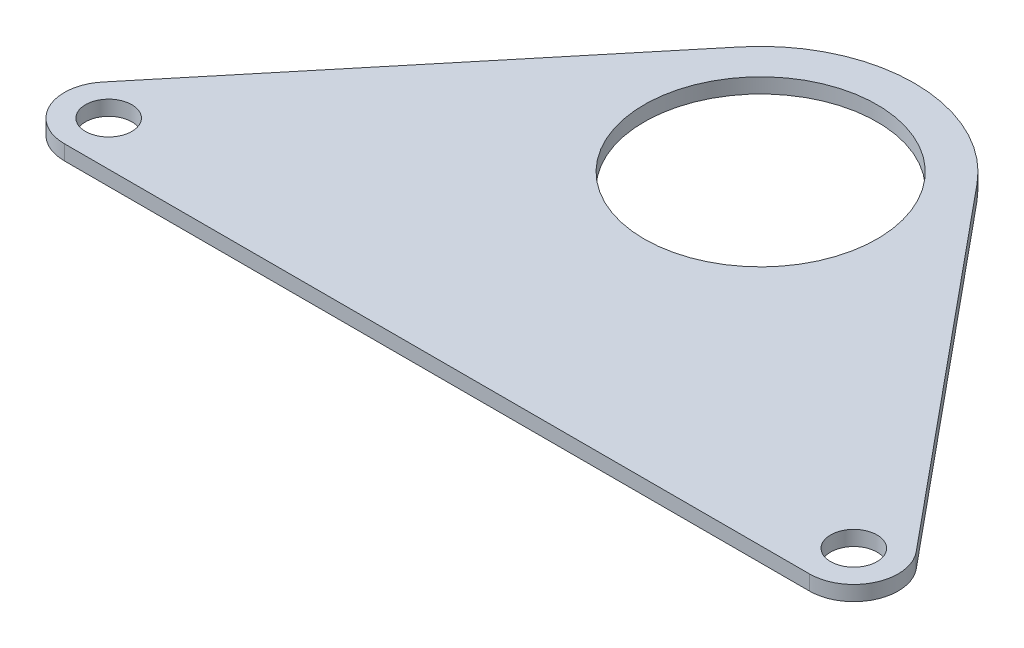
ISO-10303-21;
HEADER;
FILE_DESCRIPTION(('STEP AP214'),'2;1');
FILE_NAME('part.step','',(''),(''),'','','');
FILE_SCHEMA(('AUTOMOTIVE_DESIGN { 1 0 10303 214 1 1 1 1 }'));
ENDSEC;
DATA;
#1=APPLICATION_CONTEXT('core data for automotive mechanical design processes');
#2=APPLICATION_PROTOCOL_DEFINITION('international standard','automotive_design',2000,#1);
#3=PRODUCT_CONTEXT('',#1,'mechanical');
#4=PRODUCT('Part','Part','',(#3));
#5=PRODUCT_RELATED_PRODUCT_CATEGORY('part','',(#4));
#6=PRODUCT_DEFINITION_FORMATION('','',#4);
#7=PRODUCT_DEFINITION_CONTEXT('part definition',#1,'design');
#8=PRODUCT_DEFINITION('design','',#6,#7);
#9=PRODUCT_DEFINITION_SHAPE('','',#8);
#10=(LENGTH_UNIT() NAMED_UNIT(*) SI_UNIT(.MILLI.,.METRE.));
#11=(NAMED_UNIT(*) PLANE_ANGLE_UNIT() SI_UNIT($,.RADIAN.));
#12=(NAMED_UNIT(*) SI_UNIT($,.STERADIAN.) SOLID_ANGLE_UNIT());
#13=UNCERTAINTY_MEASURE_WITH_UNIT(LENGTH_MEASURE(1.E-05),#10,'distance_accuracy_value','');
#14=(GEOMETRIC_REPRESENTATION_CONTEXT(3) GLOBAL_UNCERTAINTY_ASSIGNED_CONTEXT((#13)) GLOBAL_UNIT_ASSIGNED_CONTEXT((#10,
#11,#12)) REPRESENTATION_CONTEXT('',''));
#15=CARTESIAN_POINT('',(0.,0.,0.));
#16=DIRECTION('',(0.,0.,1.));
#17=DIRECTION('',(1.,0.,0.));
#18=AXIS2_PLACEMENT_3D('',#15,#16,#17);
#19=CARTESIAN_POINT('',(-40.,1.6002,30.));
#20=DIRECTION('',(0.,-1.,0.));
#21=DIRECTION('',(0.,0.,-1.));
#22=AXIS2_PLACEMENT_3D('',#19,#20,#21);
#23=CYLINDRICAL_SURFACE('',#22,4.76250000000001);
#24=CARTESIAN_POINT('',(-40.,0.,30.));
#25=DIRECTION('',(0.,1.,0.));
#26=DIRECTION('',(0.,0.,1.));
#27=AXIS2_PLACEMENT_3D('',#24,#25,#26);
#28=CIRCLE('',#27,4.76250000000001);
#29=CARTESIAN_POINT('',(-40.,0.,34.7625));
#30=VERTEX_POINT('',#29);
#31=CARTESIAN_POINT('',(-43.6720468885112,0.,26.9672656069851));
#32=VERTEX_POINT('',#31);
#33=EDGE_CURVE('E122',#30,#32,#28,.F.);
#34=ORIENTED_EDGE('',*,*,#33,.F.);
#35=DIRECTION('',(0.,-1.,0.));
#36=VECTOR('',#35,1.);
#37=CARTESIAN_POINT('',(-40.,1.6002,34.7625));
#38=LINE('',#37,#36);
#39=CARTESIAN_POINT('',(-40.,1.6002,34.7625));
#40=VERTEX_POINT('',#39);
#41=EDGE_CURVE('E11',#40,#30,#38,.T.);
#42=ORIENTED_EDGE('',*,*,#41,.F.);
#43=CARTESIAN_POINT('',(-40.,1.6002,30.));
#44=DIRECTION('',(0.,1.,0.));
#45=DIRECTION('',(0.,0.,1.));
#46=AXIS2_PLACEMENT_3D('',#43,#44,#45);
#47=CIRCLE('',#46,4.76250000000001);
#48=CARTESIAN_POINT('',(-43.6720468885112,1.6002,26.9672656069851));
#49=VERTEX_POINT('',#48);
#50=EDGE_CURVE('E138',#40,#49,#47,.F.);
#51=ORIENTED_EDGE('',*,*,#50,.T.);
#52=DIRECTION('',(0.,-1.,0.));
#53=VECTOR('',#52,1.);
#54=CARTESIAN_POINT('',(-43.6720468885112,1.6002,26.9672656069851));
#55=LINE('',#54,#53);
#56=EDGE_CURVE('E80',#49,#32,#55,.T.);
#57=ORIENTED_EDGE('',*,*,#56,.T.);
#58=EDGE_LOOP('',(#34,#42,#51,#57));
#59=FACE_BOUND('',#58,.T.);
#60=ADVANCED_FACE('F34',(#59),#23,.T.);
#61=CARTESIAN_POINT('',(0.,1.6002,34.7625));
#62=DIRECTION('',(0.,0.,-1.));
#63=DIRECTION('',(-1.,0.,0.));
#64=AXIS2_PLACEMENT_3D('',#61,#62,#63);
#65=PLANE('',#64);
#66=DIRECTION('',(1.,0.,0.));
#67=VECTOR('',#66,1.);
#68=CARTESIAN_POINT('',(0.,0.,34.7625));
#69=LINE('',#68,#67);
#70=CARTESIAN_POINT('',(40.,0.,34.7625));
#71=VERTEX_POINT('',#70);
#72=EDGE_CURVE('E125',#30,#71,#69,.T.);
#73=ORIENTED_EDGE('',*,*,#72,.T.);
#74=DIRECTION('',(0.,-1.,0.));
#75=VECTOR('',#74,1.);
#76=CARTESIAN_POINT('',(40.,1.6002,34.7625));
#77=LINE('',#76,#75);
#78=CARTESIAN_POINT('',(40.,1.6002,34.7625));
#79=VERTEX_POINT('',#78);
#80=EDGE_CURVE('E43',#79,#71,#77,.T.);
#81=ORIENTED_EDGE('',*,*,#80,.F.);
#82=DIRECTION('',(1.,0.,0.));
#83=VECTOR('',#82,1.);
#84=CARTESIAN_POINT('',(0.,1.6002,34.7625));
#85=LINE('',#84,#83);
#86=EDGE_CURVE('E114',#40,#79,#85,.T.);
#87=ORIENTED_EDGE('',*,*,#86,.F.);
#88=ORIENTED_EDGE('',*,*,#41,.T.);
#89=EDGE_LOOP('',(#73,#81,#87,#88));
#90=FACE_BOUND('',#89,.T.);
#91=ADVANCED_FACE('F157',(#90),#65,.F.);
#92=CARTESIAN_POINT('',(40.,1.6002,30.));
#93=DIRECTION('',(0.,-1.,0.));
#94=DIRECTION('',(0.,0.,-1.));
#95=AXIS2_PLACEMENT_3D('',#92,#93,#94);
#96=CYLINDRICAL_SURFACE('',#95,4.76250000000001);
#97=CARTESIAN_POINT('',(40.,0.,30.));
#98=DIRECTION('',(0.,1.,0.));
#99=DIRECTION('',(0.,0.,1.));
#100=AXIS2_PLACEMENT_3D('',#97,#98,#99);
#101=CIRCLE('',#100,4.76250000000001);
#102=CARTESIAN_POINT('',(43.6720468885112,0.,26.9672656069851));
#103=VERTEX_POINT('',#102);
#104=EDGE_CURVE('E128',#71,#103,#101,.T.);
#105=ORIENTED_EDGE('',*,*,#104,.T.);
#106=DIRECTION('',(0.,-1.,0.));
#107=VECTOR('',#106,1.);
#108=CARTESIAN_POINT('',(43.6720468885112,1.6002,26.9672656069851));
#109=LINE('',#108,#107);
#110=CARTESIAN_POINT('',(43.6720468885112,1.6002,26.9672656069851));
#111=VERTEX_POINT('',#110);
#112=EDGE_CURVE('E102',#111,#103,#109,.T.);
#113=ORIENTED_EDGE('',*,*,#112,.F.);
#114=CARTESIAN_POINT('',(40.,1.6002,30.));
#115=DIRECTION('',(0.,1.,0.));
#116=DIRECTION('',(0.,0.,1.));
#117=AXIS2_PLACEMENT_3D('',#114,#115,#116);
#118=CIRCLE('',#117,4.76250000000001);
#119=EDGE_CURVE('E111',#79,#111,#118,.T.);
#120=ORIENTED_EDGE('',*,*,#119,.F.);
#121=ORIENTED_EDGE('',*,*,#80,.T.);
#122=EDGE_LOOP('',(#105,#113,#120,#121));
#123=FACE_BOUND('',#122,.T.);
#124=ADVANCED_FACE('F161',(#123),#96,.T.);
#125=CARTESIAN_POINT('',(12.7220522121647,1.6002,-10.5071112828863));
#126=DIRECTION('',(0.77103346740392,0.,-0.636794623205228));
#127=DIRECTION('',(-0.636794623205228,0.,-0.77103346740392));
#128=AXIS2_PLACEMENT_3D('',#125,#126,#127);
#129=PLANE('',#128);
#130=DIRECTION('',(0.636794623205228,0.,0.77103346740392));
#131=VECTOR('',#130,1.);
#132=CARTESIAN_POINT('',(12.7220522121647,0.,-10.5071112828863));
#133=LINE('',#132,#131);
#134=CARTESIAN_POINT('',(12.7220522121647,0.,-10.5071112828863));
#135=VERTEX_POINT('',#134);
#136=EDGE_CURVE('E101',#135,#103,#133,.T.);
#137=ORIENTED_EDGE('',*,*,#136,.F.);
#138=DIRECTION('',(0.,-1.,0.));
#139=VECTOR('',#138,1.);
#140=CARTESIAN_POINT('',(12.7220522121647,1.6002,-10.5071112828863));
#141=LINE('',#140,#139);
#142=CARTESIAN_POINT('',(12.7220522121647,1.6002,-10.5071112828863));
#143=VERTEX_POINT('',#142);
#144=EDGE_CURVE('E95',#143,#135,#141,.T.);
#145=ORIENTED_EDGE('',*,*,#144,.F.);
#146=DIRECTION('',(0.636794623205228,0.,0.77103346740392));
#147=VECTOR('',#146,1.);
#148=CARTESIAN_POINT('',(12.7220522121647,1.6002,-10.5071112828863));
#149=LINE('',#148,#147);
#150=EDGE_CURVE('E99',#143,#111,#149,.T.);
#151=ORIENTED_EDGE('',*,*,#150,.T.);
#152=ORIENTED_EDGE('',*,*,#112,.T.);
#153=EDGE_LOOP('',(#137,#145,#151,#152));
#154=FACE_BOUND('',#153,.T.);
#155=ADVANCED_FACE('F97',(#154),#129,.T.);
#156=CARTESIAN_POINT('',(0.,1.6002,0.));
#157=DIRECTION('',(0.,-1.,0.));
#158=DIRECTION('',(0.,0.,-1.));
#159=AXIS2_PLACEMENT_3D('',#156,#157,#158);
#160=CYLINDRICAL_SURFACE('',#159,16.5);
#161=CARTESIAN_POINT('',(0.,0.,0.));
#162=DIRECTION('',(0.,1.,0.));
#163=DIRECTION('',(0.,0.,1.));
#164=AXIS2_PLACEMENT_3D('',#161,#162,#163);
#165=CIRCLE('',#164,16.5);
#166=CARTESIAN_POINT('',(-12.7220522121647,0.,-10.5071112828862));
#167=VERTEX_POINT('',#166);
#168=EDGE_CURVE('E73',#135,#167,#165,.T.);
#169=ORIENTED_EDGE('',*,*,#168,.T.);
#170=DIRECTION('',(0.,-1.,0.));
#171=VECTOR('',#170,1.);
#172=CARTESIAN_POINT('',(-12.7220522121647,1.6002,-10.5071112828862));
#173=LINE('',#172,#171);
#174=CARTESIAN_POINT('',(-12.7220522121647,1.6002,-10.5071112828862));
#175=VERTEX_POINT('',#174);
#176=EDGE_CURVE('E103',#175,#167,#173,.T.);
#177=ORIENTED_EDGE('',*,*,#176,.F.);
#178=CARTESIAN_POINT('',(0.,1.6002,0.));
#179=DIRECTION('',(0.,1.,0.));
#180=DIRECTION('',(0.,0.,1.));
#181=AXIS2_PLACEMENT_3D('',#178,#179,#180);
#182=CIRCLE('',#181,16.5);
#183=EDGE_CURVE('E105',#143,#175,#182,.T.);
#184=ORIENTED_EDGE('',*,*,#183,.F.);
#185=ORIENTED_EDGE('',*,*,#144,.T.);
#186=EDGE_LOOP('',(#169,#177,#184,#185));
#187=FACE_BOUND('',#186,.T.);
#188=ADVANCED_FACE('F106',(#187),#160,.T.);
#189=CARTESIAN_POINT('',(-12.7220522121647,1.6002,-10.5071112828863));
#190=DIRECTION('',(0.771033467403921,0.,0.636794623205227));
#191=DIRECTION('',(0.636794623205227,0.,-0.771033467403921));
#192=AXIS2_PLACEMENT_3D('',#189,#190,#191);
#193=PLANE('',#192);
#194=DIRECTION('',(-0.636794623205228,0.,0.771033467403921));
#195=VECTOR('',#194,1.);
#196=CARTESIAN_POINT('',(-12.7220522121647,0.,-10.5071112828863));
#197=LINE('',#196,#195);
#198=EDGE_CURVE('E133',#167,#32,#197,.T.);
#199=ORIENTED_EDGE('',*,*,#198,.T.);
#200=ORIENTED_EDGE('',*,*,#56,.F.);
#201=DIRECTION('',(-0.636794623205228,0.,0.771033467403921));
#202=VECTOR('',#201,1.);
#203=CARTESIAN_POINT('',(-12.7220522121647,1.6002,-10.5071112828863));
#204=LINE('',#203,#202);
#205=EDGE_CURVE('E52',#175,#49,#204,.T.);
#206=ORIENTED_EDGE('',*,*,#205,.F.);
#207=ORIENTED_EDGE('',*,*,#176,.T.);
#208=EDGE_LOOP('',(#199,#200,#206,#207));
#209=FACE_BOUND('',#208,.T.);
#210=ADVANCED_FACE('F167',(#209),#193,.F.);
#211=CARTESIAN_POINT('',(0.,1.6002,0.));
#212=DIRECTION('',(0.,-1.,0.));
#213=DIRECTION('',(0.,0.,-1.));
#214=AXIS2_PLACEMENT_3D('',#211,#212,#213);
#215=CYLINDRICAL_SURFACE('',#214,12.5);
#216=CARTESIAN_POINT('',(0.,1.6002,0.));
#217=DIRECTION('',(0.,1.,0.));
#218=DIRECTION('',(0.,0.,1.));
#219=AXIS2_PLACEMENT_3D('',#216,#217,#218);
#220=CIRCLE('',#219,12.5);
#221=CARTESIAN_POINT('',(0.,1.6002,12.5));
#222=VERTEX_POINT('',#221);
#223=EDGE_CURVE('E119',#222,#222,#220,.T.);
#224=ORIENTED_EDGE('',*,*,#223,.T.);
#225=EDGE_LOOP('',(#224));
#226=FACE_BOUND('',#225,.T.);
#227=CARTESIAN_POINT('',(0.,0.,0.));
#228=DIRECTION('',(0.,1.,0.));
#229=DIRECTION('',(0.,0.,1.));
#230=AXIS2_PLACEMENT_3D('',#227,#228,#229);
#231=CIRCLE('',#230,12.5);
#232=CARTESIAN_POINT('',(0.,0.,12.5));
#233=VERTEX_POINT('',#232);
#234=EDGE_CURVE('E135',#233,#233,#231,.T.);
#235=ORIENTED_EDGE('',*,*,#234,.F.);
#236=EDGE_LOOP('',(#235));
#237=FACE_BOUND('',#236,.T.);
#238=ADVANCED_FACE('F183',(#226,#237),#215,.F.);
#239=CARTESIAN_POINT('',(0.,1.6002,0.));
#240=DIRECTION('',(0.,1.,0.));
#241=DIRECTION('',(0.,0.,1.));
#242=AXIS2_PLACEMENT_3D('',#239,#240,#241);
#243=PLANE('',#242);
#244=CARTESIAN_POINT('',(40.,1.6002,30.));
#245=DIRECTION('',(0.,1.,0.));
#246=DIRECTION('',(0.,0.,1.));
#247=AXIS2_PLACEMENT_3D('',#244,#245,#246);
#248=CIRCLE('',#247,2.48919999999998);
#249=CARTESIAN_POINT('',(40.,1.6002,32.4892));
#250=VERTEX_POINT('',#249);
#251=EDGE_CURVE('E152',#250,#250,#248,.T.);
#252=ORIENTED_EDGE('',*,*,#251,.F.);
#253=EDGE_LOOP('',(#252));
#254=FACE_BOUND('',#253,.T.);
#255=CARTESIAN_POINT('',(-40.,1.6002,30.));
#256=DIRECTION('',(0.,1.,0.));
#257=DIRECTION('',(0.,0.,1.));
#258=AXIS2_PLACEMENT_3D('',#255,#256,#257);
#259=CIRCLE('',#258,2.48919999999998);
#260=CARTESIAN_POINT('',(-40.,1.6002,32.4892));
#261=VERTEX_POINT('',#260);
#262=EDGE_CURVE('E144',#261,#261,#259,.T.);
#263=ORIENTED_EDGE('',*,*,#262,.F.);
#264=EDGE_LOOP('',(#263));
#265=FACE_BOUND('',#264,.T.);
#266=ORIENTED_EDGE('',*,*,#50,.F.);
#267=ORIENTED_EDGE('',*,*,#86,.T.);
#268=ORIENTED_EDGE('',*,*,#119,.T.);
#269=ORIENTED_EDGE('',*,*,#150,.F.);
#270=ORIENTED_EDGE('',*,*,#183,.T.);
#271=ORIENTED_EDGE('',*,*,#205,.T.);
#272=EDGE_LOOP('',(#266,#267,#268,#269,#270,#271));
#273=FACE_BOUND('',#272,.T.);
#274=ORIENTED_EDGE('',*,*,#223,.F.);
#275=EDGE_LOOP('',(#274));
#276=FACE_BOUND('',#275,.T.);
#277=ADVANCED_FACE('F108',(#254,#265,#273,#276),#243,.T.);
#278=CARTESIAN_POINT('',(0.,0.,0.));
#279=DIRECTION('',(0.,1.,0.));
#280=DIRECTION('',(0.,0.,1.));
#281=AXIS2_PLACEMENT_3D('',#278,#279,#280);
#282=PLANE('',#281);
#283=CARTESIAN_POINT('',(40.,0.,30.));
#284=DIRECTION('',(0.,1.,0.));
#285=DIRECTION('',(0.,0.,1.));
#286=AXIS2_PLACEMENT_3D('',#283,#284,#285);
#287=CIRCLE('',#286,2.48919999999997);
#288=CARTESIAN_POINT('',(40.,0.,32.4892));
#289=VERTEX_POINT('',#288);
#290=EDGE_CURVE('E37',#289,#289,#287,.T.);
#291=ORIENTED_EDGE('',*,*,#290,.T.);
#292=EDGE_LOOP('',(#291));
#293=FACE_BOUND('',#292,.T.);
#294=CARTESIAN_POINT('',(-40.,0.,30.));
#295=DIRECTION('',(0.,1.,0.));
#296=DIRECTION('',(0.,0.,1.));
#297=AXIS2_PLACEMENT_3D('',#294,#295,#296);
#298=CIRCLE('',#297,2.48919999999997);
#299=CARTESIAN_POINT('',(-40.,0.,32.4892));
#300=VERTEX_POINT('',#299);
#301=EDGE_CURVE('E126',#300,#300,#298,.T.);
#302=ORIENTED_EDGE('',*,*,#301,.T.);
#303=EDGE_LOOP('',(#302));
#304=FACE_BOUND('',#303,.T.);
#305=ORIENTED_EDGE('',*,*,#33,.T.);
#306=ORIENTED_EDGE('',*,*,#198,.F.);
#307=ORIENTED_EDGE('',*,*,#168,.F.);
#308=ORIENTED_EDGE('',*,*,#136,.T.);
#309=ORIENTED_EDGE('',*,*,#104,.F.);
#310=ORIENTED_EDGE('',*,*,#72,.F.);
#311=EDGE_LOOP('',(#305,#306,#307,#308,#309,#310));
#312=FACE_BOUND('',#311,.T.);
#313=ORIENTED_EDGE('',*,*,#234,.T.);
#314=EDGE_LOOP('',(#313));
#315=FACE_BOUND('',#314,.T.);
#316=ADVANCED_FACE('F163',(#293,#304,#312,#315),#282,.F.);
#317=CARTESIAN_POINT('',(-40.,1.6002,30.));
#318=DIRECTION('',(0.,1.,0.));
#319=DIRECTION('',(0.,0.,1.));
#320=AXIS2_PLACEMENT_3D('',#317,#318,#319);
#321=CYLINDRICAL_SURFACE('',#320,2.48919999999997);
#322=ORIENTED_EDGE('',*,*,#262,.T.);
#323=EDGE_LOOP('',(#322));
#324=FACE_BOUND('',#323,.T.);
#325=ORIENTED_EDGE('',*,*,#301,.F.);
#326=EDGE_LOOP('',(#325));
#327=FACE_BOUND('',#326,.T.);
#328=ADVANCED_FACE('F189',(#324,#327),#321,.F.);
#329=CARTESIAN_POINT('',(40.,1.6002,30.));
#330=DIRECTION('',(0.,1.,0.));
#331=DIRECTION('',(0.,0.,1.));
#332=AXIS2_PLACEMENT_3D('',#329,#330,#331);
#333=CYLINDRICAL_SURFACE('',#332,2.48919999999997);
#334=ORIENTED_EDGE('',*,*,#251,.T.);
#335=EDGE_LOOP('',(#334));
#336=FACE_BOUND('',#335,.T.);
#337=ORIENTED_EDGE('',*,*,#290,.F.);
#338=EDGE_LOOP('',(#337));
#339=FACE_BOUND('',#338,.T.);
#340=ADVANCED_FACE('F196',(#336,#339),#333,.F.);
#341=CLOSED_SHELL('',(#60,#91,#124,#155,#188,#210,#238,#277,#316,#328,#340));
#342=MANIFOLD_SOLID_BREP('B2',#341);
#343=ADVANCED_BREP_SHAPE_REPRESENTATION('',(#18,#342),#14);
#344=SHAPE_DEFINITION_REPRESENTATION(#9,#343);
ENDSEC;
END-ISO-10303-21;
